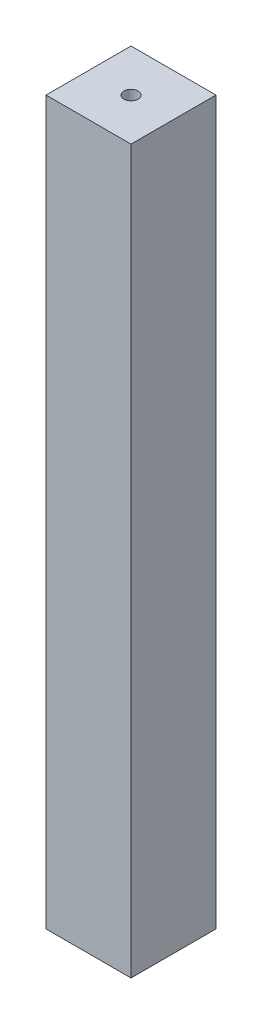
ISO-10303-21;
HEADER;
FILE_DESCRIPTION(('STEP AP214'),'2;1');
FILE_NAME('part.step','',(''),(''),'','','');
FILE_SCHEMA(('AUTOMOTIVE_DESIGN { 1 0 10303 214 1 1 1 1 }'));
ENDSEC;
DATA;
#1=APPLICATION_CONTEXT('core data for automotive mechanical design processes');
#2=APPLICATION_PROTOCOL_DEFINITION('international standard','automotive_design',2000,#1);
#3=PRODUCT_CONTEXT('',#1,'mechanical');
#4=PRODUCT('Part','Part','',(#3));
#5=PRODUCT_RELATED_PRODUCT_CATEGORY('part','',(#4));
#6=PRODUCT_DEFINITION_FORMATION('','',#4);
#7=PRODUCT_DEFINITION_CONTEXT('part definition',#1,'design');
#8=PRODUCT_DEFINITION('design','',#6,#7);
#9=PRODUCT_DEFINITION_SHAPE('','',#8);
#10=(LENGTH_UNIT() NAMED_UNIT(*) SI_UNIT(.MILLI.,.METRE.));
#11=(NAMED_UNIT(*) PLANE_ANGLE_UNIT() SI_UNIT($,.RADIAN.));
#12=(NAMED_UNIT(*) SI_UNIT($,.STERADIAN.) SOLID_ANGLE_UNIT());
#13=UNCERTAINTY_MEASURE_WITH_UNIT(LENGTH_MEASURE(1.E-05),#10,'distance_accuracy_value','');
#14=(GEOMETRIC_REPRESENTATION_CONTEXT(3) GLOBAL_UNCERTAINTY_ASSIGNED_CONTEXT((#13)) GLOBAL_UNIT_ASSIGNED_CONTEXT((#10,
#11,#12)) REPRESENTATION_CONTEXT('',''));
#15=CARTESIAN_POINT('',(0.,0.,0.));
#16=DIRECTION('',(0.,0.,1.));
#17=DIRECTION('',(1.,0.,0.));
#18=AXIS2_PLACEMENT_3D('',#15,#16,#17);
#19=CARTESIAN_POINT('',(0.,0.,0.));
#20=DIRECTION('',(0.,-1.,0.));
#21=DIRECTION('',(0.,0.,-1.));
#22=AXIS2_PLACEMENT_3D('',#19,#20,#21);
#23=PLANE('',#22);
#24=DIRECTION('',(0.,0.,1.));
#25=VECTOR('',#24,1.);
#26=CARTESIAN_POINT('',(0.,0.,0.));
#27=LINE('',#26,#25);
#28=CARTESIAN_POINT('',(0.,0.,-30.));
#29=VERTEX_POINT('',#28);
#30=CARTESIAN_POINT('',(0.,0.,0.));
#31=VERTEX_POINT('',#30);
#32=EDGE_CURVE('E172',#29,#31,#27,.T.);
#33=ORIENTED_EDGE('',*,*,#32,.F.);
#34=DIRECTION('',(-1.,0.,0.));
#35=VECTOR('',#34,1.);
#36=CARTESIAN_POINT('',(0.,0.,-30.));
#37=LINE('',#36,#35);
#38=CARTESIAN_POINT('',(30.,0.,-30.));
#39=VERTEX_POINT('',#38);
#40=EDGE_CURVE('E68',#39,#29,#37,.T.);
#41=ORIENTED_EDGE('',*,*,#40,.F.);
#42=DIRECTION('',(0.,0.,-1.));
#43=VECTOR('',#42,1.);
#44=CARTESIAN_POINT('',(30.,0.,0.));
#45=LINE('',#44,#43);
#46=CARTESIAN_POINT('',(30.,0.,0.));
#47=VERTEX_POINT('',#46);
#48=EDGE_CURVE('E176',#47,#39,#45,.T.);
#49=ORIENTED_EDGE('',*,*,#48,.F.);
#50=DIRECTION('',(1.,0.,0.));
#51=VECTOR('',#50,1.);
#52=CARTESIAN_POINT('',(0.,0.,0.));
#53=LINE('',#52,#51);
#54=EDGE_CURVE('E174',#31,#47,#53,.T.);
#55=ORIENTED_EDGE('',*,*,#54,.F.);
#56=EDGE_LOOP('',(#33,#41,#49,#55));
#57=FACE_BOUND('',#56,.T.);
#58=DIRECTION('',(0.,0.,1.));
#59=VECTOR('',#58,1.);
#60=CARTESIAN_POINT('',(5.,0.,-5.));
#61=LINE('',#60,#59);
#62=CARTESIAN_POINT('',(5.,0.,-25.));
#63=VERTEX_POINT('',#62);
#64=CARTESIAN_POINT('',(5.,0.,-5.));
#65=VERTEX_POINT('',#64);
#66=EDGE_CURVE('E146',#63,#65,#61,.T.);
#67=ORIENTED_EDGE('',*,*,#66,.T.);
#68=DIRECTION('',(1.,0.,0.));
#69=VECTOR('',#68,1.);
#70=CARTESIAN_POINT('',(5.,0.,-5.));
#71=LINE('',#70,#69);
#72=CARTESIAN_POINT('',(25.,0.,-5.));
#73=VERTEX_POINT('',#72);
#74=EDGE_CURVE('E60',#65,#73,#71,.T.);
#75=ORIENTED_EDGE('',*,*,#74,.T.);
#76=DIRECTION('',(0.,0.,-1.));
#77=VECTOR('',#76,1.);
#78=CARTESIAN_POINT('',(25.,0.,-5.));
#79=LINE('',#78,#77);
#80=CARTESIAN_POINT('',(25.,0.,-25.));
#81=VERTEX_POINT('',#80);
#82=EDGE_CURVE('E157',#73,#81,#79,.T.);
#83=ORIENTED_EDGE('',*,*,#82,.T.);
#84=DIRECTION('',(-1.,0.,0.));
#85=VECTOR('',#84,1.);
#86=CARTESIAN_POINT('',(5.,0.,-25.));
#87=LINE('',#86,#85);
#88=EDGE_CURVE('E160',#81,#63,#87,.T.);
#89=ORIENTED_EDGE('',*,*,#88,.T.);
#90=EDGE_LOOP('',(#67,#75,#83,#89));
#91=FACE_BOUND('',#90,.T.);
#92=ADVANCED_FACE('F45',(#57,#91),#23,.T.);
#93=CARTESIAN_POINT('',(0.,250.,0.));
#94=DIRECTION('',(1.,0.,0.));
#95=DIRECTION('',(0.,0.,-1.));
#96=AXIS2_PLACEMENT_3D('',#93,#94,#95);
#97=PLANE('',#96);
#98=ORIENTED_EDGE('',*,*,#32,.T.);
#99=DIRECTION('',(0.,-1.,0.));
#100=VECTOR('',#99,1.);
#101=CARTESIAN_POINT('',(0.,250.,0.));
#102=LINE('',#101,#100);
#103=CARTESIAN_POINT('',(0.,255.,0.));
#104=VERTEX_POINT('',#103);
#105=EDGE_CURVE('E11',#104,#31,#102,.T.);
#106=ORIENTED_EDGE('',*,*,#105,.F.);
#107=DIRECTION('',(0.,0.,1.));
#108=VECTOR('',#107,1.);
#109=CARTESIAN_POINT('',(0.,255.,-30.));
#110=LINE('',#109,#108);
#111=CARTESIAN_POINT('',(0.,255.,-30.));
#112=VERTEX_POINT('',#111);
#113=EDGE_CURVE('E122',#112,#104,#110,.T.);
#114=ORIENTED_EDGE('',*,*,#113,.F.);
#115=DIRECTION('',(0.,-1.,0.));
#116=VECTOR('',#115,1.);
#117=CARTESIAN_POINT('',(0.,250.,-30.));
#118=LINE('',#117,#116);
#119=EDGE_CURVE('E111',#112,#29,#118,.T.);
#120=ORIENTED_EDGE('',*,*,#119,.T.);
#121=EDGE_LOOP('',(#98,#106,#114,#120));
#122=FACE_BOUND('',#121,.T.);
#123=ADVANCED_FACE('F47',(#122),#97,.F.);
#124=CARTESIAN_POINT('',(0.,250.,0.));
#125=DIRECTION('',(0.,0.,-1.));
#126=DIRECTION('',(-1.,0.,0.));
#127=AXIS2_PLACEMENT_3D('',#124,#125,#126);
#128=PLANE('',#127);
#129=ORIENTED_EDGE('',*,*,#54,.T.);
#130=DIRECTION('',(0.,-1.,0.));
#131=VECTOR('',#130,1.);
#132=CARTESIAN_POINT('',(30.,250.,0.));
#133=LINE('',#132,#131);
#134=CARTESIAN_POINT('',(30.,255.,0.));
#135=VERTEX_POINT('',#134);
#136=EDGE_CURVE('E53',#135,#47,#133,.T.);
#137=ORIENTED_EDGE('',*,*,#136,.F.);
#138=DIRECTION('',(1.,0.,0.));
#139=VECTOR('',#138,1.);
#140=CARTESIAN_POINT('',(0.,255.,0.));
#141=LINE('',#140,#139);
#142=EDGE_CURVE('E126',#104,#135,#141,.T.);
#143=ORIENTED_EDGE('',*,*,#142,.F.);
#144=ORIENTED_EDGE('',*,*,#105,.T.);
#145=EDGE_LOOP('',(#129,#137,#143,#144));
#146=FACE_BOUND('',#145,.T.);
#147=ADVANCED_FACE('F186',(#146),#128,.F.);
#148=CARTESIAN_POINT('',(30.,250.,0.));
#149=DIRECTION('',(-1.,0.,0.));
#150=DIRECTION('',(0.,0.,1.));
#151=AXIS2_PLACEMENT_3D('',#148,#149,#150);
#152=PLANE('',#151);
#153=ORIENTED_EDGE('',*,*,#48,.T.);
#154=DIRECTION('',(0.,-1.,0.));
#155=VECTOR('',#154,1.);
#156=CARTESIAN_POINT('',(30.,250.,-30.));
#157=LINE('',#156,#155);
#158=CARTESIAN_POINT('',(30.,255.,-30.));
#159=VERTEX_POINT('',#158);
#160=EDGE_CURVE('E119',#159,#39,#157,.T.);
#161=ORIENTED_EDGE('',*,*,#160,.F.);
#162=DIRECTION('',(0.,0.,-1.));
#163=VECTOR('',#162,1.);
#164=CARTESIAN_POINT('',(30.,255.,0.));
#165=LINE('',#164,#163);
#166=EDGE_CURVE('E132',#135,#159,#165,.T.);
#167=ORIENTED_EDGE('',*,*,#166,.F.);
#168=ORIENTED_EDGE('',*,*,#136,.T.);
#169=EDGE_LOOP('',(#153,#161,#167,#168));
#170=FACE_BOUND('',#169,.T.);
#171=ADVANCED_FACE('F182',(#170),#152,.F.);
#172=CARTESIAN_POINT('',(0.,250.,-30.));
#173=DIRECTION('',(0.,0.,1.));
#174=DIRECTION('',(1.,0.,0.));
#175=AXIS2_PLACEMENT_3D('',#172,#173,#174);
#176=PLANE('',#175);
#177=ORIENTED_EDGE('',*,*,#40,.T.);
#178=ORIENTED_EDGE('',*,*,#119,.F.);
#179=DIRECTION('',(-1.,0.,0.));
#180=VECTOR('',#179,1.);
#181=CARTESIAN_POINT('',(30.,255.,-30.));
#182=LINE('',#181,#180);
#183=EDGE_CURVE('E115',#159,#112,#182,.T.);
#184=ORIENTED_EDGE('',*,*,#183,.F.);
#185=ORIENTED_EDGE('',*,*,#160,.T.);
#186=EDGE_LOOP('',(#177,#178,#184,#185));
#187=FACE_BOUND('',#186,.T.);
#188=ADVANCED_FACE('F113',(#187),#176,.F.);
#189=CARTESIAN_POINT('',(5.,250.,-5.));
#190=DIRECTION('',(0.,0.,-1.));
#191=DIRECTION('',(-1.,0.,0.));
#192=AXIS2_PLACEMENT_3D('',#189,#190,#191);
#193=PLANE('',#192);
#194=ORIENTED_EDGE('',*,*,#74,.F.);
#195=DIRECTION('',(0.,-1.,0.));
#196=VECTOR('',#195,1.);
#197=CARTESIAN_POINT('',(5.,250.,-5.));
#198=LINE('',#197,#196);
#199=CARTESIAN_POINT('',(5.,250.,-5.));
#200=VERTEX_POINT('',#199);
#201=EDGE_CURVE('E155',#200,#65,#198,.T.);
#202=ORIENTED_EDGE('',*,*,#201,.F.);
#203=DIRECTION('',(1.,0.,0.));
#204=VECTOR('',#203,1.);
#205=CARTESIAN_POINT('',(5.,250.,-5.));
#206=LINE('',#205,#204);
#207=CARTESIAN_POINT('',(25.,250.,-5.));
#208=VERTEX_POINT('',#207);
#209=EDGE_CURVE('E142',#200,#208,#206,.T.);
#210=ORIENTED_EDGE('',*,*,#209,.T.);
#211=DIRECTION('',(0.,-1.,0.));
#212=VECTOR('',#211,1.);
#213=CARTESIAN_POINT('',(25.,250.,-5.));
#214=LINE('',#213,#212);
#215=EDGE_CURVE('E170',#208,#73,#214,.T.);
#216=ORIENTED_EDGE('',*,*,#215,.T.);
#217=EDGE_LOOP('',(#194,#202,#210,#216));
#218=FACE_BOUND('',#217,.T.);
#219=ADVANCED_FACE('F199',(#218),#193,.T.);
#220=CARTESIAN_POINT('',(25.,250.,-5.));
#221=DIRECTION('',(-1.,0.,0.));
#222=DIRECTION('',(0.,0.,1.));
#223=AXIS2_PLACEMENT_3D('',#220,#221,#222);
#224=PLANE('',#223);
#225=ORIENTED_EDGE('',*,*,#82,.F.);
#226=ORIENTED_EDGE('',*,*,#215,.F.);
#227=DIRECTION('',(0.,0.,-1.));
#228=VECTOR('',#227,1.);
#229=CARTESIAN_POINT('',(25.,250.,-5.));
#230=LINE('',#229,#228);
#231=CARTESIAN_POINT('',(25.,250.,-25.));
#232=VERTEX_POINT('',#231);
#233=EDGE_CURVE('E145',#208,#232,#230,.T.);
#234=ORIENTED_EDGE('',*,*,#233,.T.);
#235=DIRECTION('',(0.,-1.,0.));
#236=VECTOR('',#235,1.);
#237=CARTESIAN_POINT('',(25.,250.,-25.));
#238=LINE('',#237,#236);
#239=EDGE_CURVE('E168',#232,#81,#238,.T.);
#240=ORIENTED_EDGE('',*,*,#239,.T.);
#241=EDGE_LOOP('',(#225,#226,#234,#240));
#242=FACE_BOUND('',#241,.T.);
#243=ADVANCED_FACE('F205',(#242),#224,.T.);
#244=CARTESIAN_POINT('',(5.,250.,-25.));
#245=DIRECTION('',(0.,0.,1.));
#246=DIRECTION('',(1.,0.,0.));
#247=AXIS2_PLACEMENT_3D('',#244,#245,#246);
#248=PLANE('',#247);
#249=ORIENTED_EDGE('',*,*,#88,.F.);
#250=ORIENTED_EDGE('',*,*,#239,.F.);
#251=DIRECTION('',(-1.,0.,0.));
#252=VECTOR('',#251,1.);
#253=CARTESIAN_POINT('',(5.,250.,-25.));
#254=LINE('',#253,#252);
#255=CARTESIAN_POINT('',(5.,250.,-25.));
#256=VERTEX_POINT('',#255);
#257=EDGE_CURVE('E149',#232,#256,#254,.T.);
#258=ORIENTED_EDGE('',*,*,#257,.T.);
#259=DIRECTION('',(0.,-1.,0.));
#260=VECTOR('',#259,1.);
#261=CARTESIAN_POINT('',(5.,250.,-25.));
#262=LINE('',#261,#260);
#263=EDGE_CURVE('E166',#256,#63,#262,.T.);
#264=ORIENTED_EDGE('',*,*,#263,.T.);
#265=EDGE_LOOP('',(#249,#250,#258,#264));
#266=FACE_BOUND('',#265,.T.);
#267=ADVANCED_FACE('F209',(#266),#248,.T.);
#268=CARTESIAN_POINT('',(5.,250.,-5.));
#269=DIRECTION('',(1.,0.,0.));
#270=DIRECTION('',(0.,0.,-1.));
#271=AXIS2_PLACEMENT_3D('',#268,#269,#270);
#272=PLANE('',#271);
#273=ORIENTED_EDGE('',*,*,#66,.F.);
#274=ORIENTED_EDGE('',*,*,#263,.F.);
#275=DIRECTION('',(0.,0.,1.));
#276=VECTOR('',#275,1.);
#277=CARTESIAN_POINT('',(5.,250.,-5.));
#278=LINE('',#277,#276);
#279=EDGE_CURVE('E152',#256,#200,#278,.T.);
#280=ORIENTED_EDGE('',*,*,#279,.T.);
#281=ORIENTED_EDGE('',*,*,#201,.T.);
#282=EDGE_LOOP('',(#273,#274,#280,#281));
#283=FACE_BOUND('',#282,.T.);
#284=ADVANCED_FACE('F214',(#283),#272,.T.);
#285=CARTESIAN_POINT('',(0.,255.,0.));
#286=DIRECTION('',(0.,1.,0.));
#287=DIRECTION('',(0.,0.,1.));
#288=AXIS2_PLACEMENT_3D('',#285,#286,#287);
#289=PLANE('',#288);
#290=ORIENTED_EDGE('',*,*,#183,.T.);
#291=ORIENTED_EDGE('',*,*,#113,.T.);
#292=ORIENTED_EDGE('',*,*,#142,.T.);
#293=ORIENTED_EDGE('',*,*,#166,.T.);
#294=EDGE_LOOP('',(#290,#291,#292,#293));
#295=FACE_BOUND('',#294,.T.);
#296=CARTESIAN_POINT('',(15.,255.,-15.));
#297=DIRECTION('',(0.,1.,0.));
#298=DIRECTION('',(0.,0.,1.));
#299=AXIS2_PLACEMENT_3D('',#296,#297,#298);
#300=CIRCLE('',#299,2.5);
#301=CARTESIAN_POINT('',(15.,255.,-12.5));
#302=VERTEX_POINT('',#301);
#303=EDGE_CURVE('E133',#302,#302,#300,.T.);
#304=ORIENTED_EDGE('',*,*,#303,.F.);
#305=EDGE_LOOP('',(#304));
#306=FACE_BOUND('',#305,.T.);
#307=ADVANCED_FACE('F129',(#295,#306),#289,.T.);
#308=CARTESIAN_POINT('',(0.,250.,0.));
#309=DIRECTION('',(0.,1.,0.));
#310=DIRECTION('',(0.,0.,1.));
#311=AXIS2_PLACEMENT_3D('',#308,#309,#310);
#312=PLANE('',#311);
#313=ORIENTED_EDGE('',*,*,#209,.F.);
#314=ORIENTED_EDGE('',*,*,#279,.F.);
#315=ORIENTED_EDGE('',*,*,#257,.F.);
#316=ORIENTED_EDGE('',*,*,#233,.F.);
#317=EDGE_LOOP('',(#313,#314,#315,#316));
#318=FACE_BOUND('',#317,.T.);
#319=CARTESIAN_POINT('',(15.,250.,-15.));
#320=DIRECTION('',(0.,1.,0.));
#321=DIRECTION('',(0.,0.,1.));
#322=AXIS2_PLACEMENT_3D('',#319,#320,#321);
#323=CIRCLE('',#322,2.5);
#324=CARTESIAN_POINT('',(15.,250.,-12.5));
#325=VERTEX_POINT('',#324);
#326=EDGE_CURVE('E136',#325,#325,#323,.T.);
#327=ORIENTED_EDGE('',*,*,#326,.T.);
#328=EDGE_LOOP('',(#327));
#329=FACE_BOUND('',#328,.T.);
#330=ADVANCED_FACE('F221',(#318,#329),#312,.F.);
#331=CARTESIAN_POINT('',(15.,255.,-15.));
#332=DIRECTION('',(0.,-1.,0.));
#333=DIRECTION('',(0.,0.,-1.));
#334=AXIS2_PLACEMENT_3D('',#331,#332,#333);
#335=CYLINDRICAL_SURFACE('',#334,2.5);
#336=ORIENTED_EDGE('',*,*,#303,.T.);
#337=EDGE_LOOP('',(#336));
#338=FACE_BOUND('',#337,.T.);
#339=ORIENTED_EDGE('',*,*,#326,.F.);
#340=EDGE_LOOP('',(#339));
#341=FACE_BOUND('',#340,.T.);
#342=ADVANCED_FACE('F224',(#338,#341),#335,.F.);
#343=CLOSED_SHELL('',(#92,#123,#147,#171,#188,#219,#243,#267,#284,#307,#330,#342));
#344=MANIFOLD_SOLID_BREP('B2',#343);
#345=ADVANCED_BREP_SHAPE_REPRESENTATION('',(#18,#344),#14);
#346=SHAPE_DEFINITION_REPRESENTATION(#9,#345);
ENDSEC;
END-ISO-10303-21;
